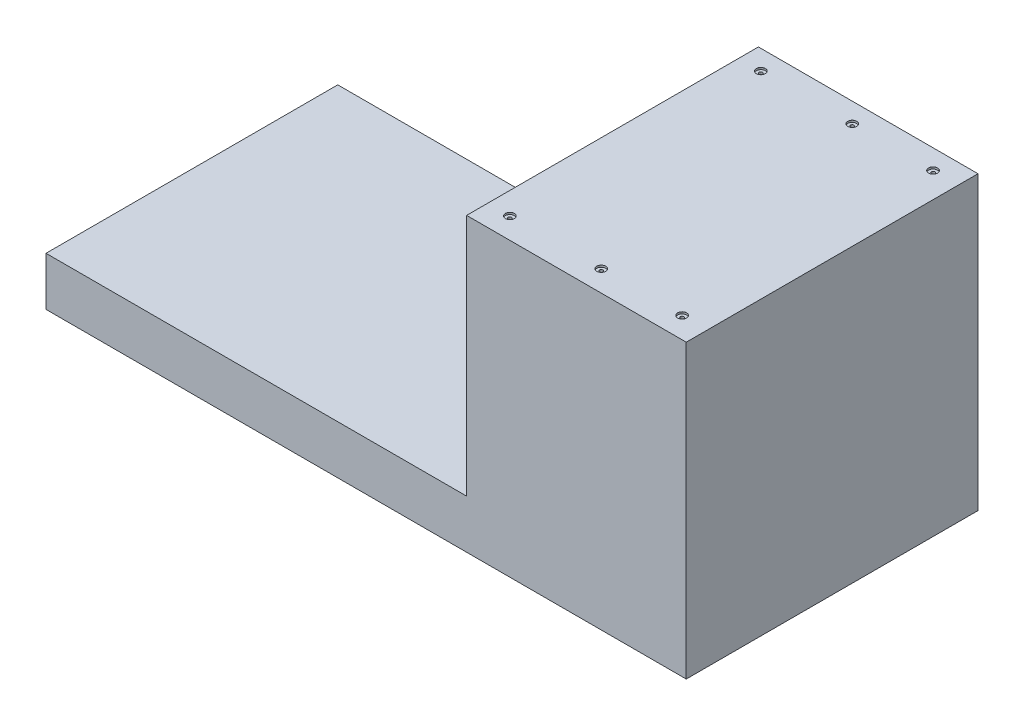
ISO-10303-21;
HEADER;
FILE_DESCRIPTION(('STEP AP214'),'2;1');
FILE_NAME('part.step','',(''),(''),'','','');
FILE_SCHEMA(('AUTOMOTIVE_DESIGN { 1 0 10303 214 1 1 1 1 }'));
ENDSEC;
DATA;
#1=APPLICATION_CONTEXT('core data for automotive mechanical design processes');
#2=APPLICATION_PROTOCOL_DEFINITION('international standard','automotive_design',2000,#1);
#3=PRODUCT_CONTEXT('',#1,'mechanical');
#4=PRODUCT('Part','Part','',(#3));
#5=PRODUCT_RELATED_PRODUCT_CATEGORY('part','',(#4));
#6=PRODUCT_DEFINITION_FORMATION('','',#4);
#7=PRODUCT_DEFINITION_CONTEXT('part definition',#1,'design');
#8=PRODUCT_DEFINITION('design','',#6,#7);
#9=PRODUCT_DEFINITION_SHAPE('','',#8);
#10=(LENGTH_UNIT() NAMED_UNIT(*) SI_UNIT(.MILLI.,.METRE.));
#11=(NAMED_UNIT(*) PLANE_ANGLE_UNIT() SI_UNIT($,.RADIAN.));
#12=(NAMED_UNIT(*) SI_UNIT($,.STERADIAN.) SOLID_ANGLE_UNIT());
#13=UNCERTAINTY_MEASURE_WITH_UNIT(LENGTH_MEASURE(1.E-05),#10,'distance_accuracy_value','');
#14=(GEOMETRIC_REPRESENTATION_CONTEXT(3) GLOBAL_UNCERTAINTY_ASSIGNED_CONTEXT((#13)) GLOBAL_UNIT_ASSIGNED_CONTEXT((#10,
#11,#12)) REPRESENTATION_CONTEXT('',''));
#15=CARTESIAN_POINT('',(0.,0.,0.));
#16=DIRECTION('',(0.,0.,1.));
#17=DIRECTION('',(1.,0.,0.));
#18=AXIS2_PLACEMENT_3D('',#15,#16,#17);
#19=CARTESIAN_POINT('',(254.,50.8,-152.4));
#20=DIRECTION('',(-1.,0.,0.));
#21=DIRECTION('',(0.,0.,1.));
#22=AXIS2_PLACEMENT_3D('',#19,#20,#21);
#23=PLANE('',#22);
#24=DIRECTION('',(0.,0.,-1.));
#25=VECTOR('',#24,1.);
#26=CARTESIAN_POINT('',(254.,0.,-152.4));
#27=LINE('',#26,#25);
#28=CARTESIAN_POINT('',(254.,0.,152.4));
#29=VERTEX_POINT('',#28);
#30=CARTESIAN_POINT('',(254.,0.,-152.4));
#31=VERTEX_POINT('',#30);
#32=EDGE_CURVE('E146',#29,#31,#27,.T.);
#33=ORIENTED_EDGE('',*,*,#32,.T.);
#34=DIRECTION('',(0.,-1.,0.));
#35=VECTOR('',#34,1.);
#36=CARTESIAN_POINT('',(254.,50.8,-152.4));
#37=LINE('',#36,#35);
#38=CARTESIAN_POINT('',(254.,304.8,-152.4));
#39=VERTEX_POINT('',#38);
#40=EDGE_CURVE('E11',#39,#31,#37,.T.);
#41=ORIENTED_EDGE('',*,*,#40,.F.);
#42=DIRECTION('',(0.,0.,-1.));
#43=VECTOR('',#42,1.);
#44=CARTESIAN_POINT('',(254.,304.8,-152.4));
#45=LINE('',#44,#43);
#46=CARTESIAN_POINT('',(254.,304.8,152.4));
#47=VERTEX_POINT('',#46);
#48=EDGE_CURVE('E134',#47,#39,#45,.T.);
#49=ORIENTED_EDGE('',*,*,#48,.F.);
#50=DIRECTION('',(0.,-1.,0.));
#51=VECTOR('',#50,1.);
#52=CARTESIAN_POINT('',(254.,50.8,152.4));
#53=LINE('',#52,#51);
#54=EDGE_CURVE('E46',#47,#29,#53,.T.);
#55=ORIENTED_EDGE('',*,*,#54,.T.);
#56=EDGE_LOOP('',(#33,#41,#49,#55));
#57=FACE_BOUND('',#56,.T.);
#58=ADVANCED_FACE('F38',(#57),#23,.F.);
#59=CARTESIAN_POINT('',(-254.,50.8,-152.4));
#60=DIRECTION('',(0.,0.,1.));
#61=DIRECTION('',(1.,0.,0.));
#62=AXIS2_PLACEMENT_3D('',#59,#60,#61);
#63=PLANE('',#62);
#64=DIRECTION('',(-1.,0.,0.));
#65=VECTOR('',#64,1.);
#66=CARTESIAN_POINT('',(-254.,0.,-152.4));
#67=LINE('',#66,#65);
#68=CARTESIAN_POINT('',(-414.851586112818,0.,-152.4));
#69=VERTEX_POINT('',#68);
#70=EDGE_CURVE('E111',#31,#69,#67,.T.);
#71=ORIENTED_EDGE('',*,*,#70,.T.);
#72=DIRECTION('',(0.,-1.,0.));
#73=VECTOR('',#72,1.);
#74=CARTESIAN_POINT('',(-414.851586112818,50.8,-152.4));
#75=LINE('',#74,#73);
#76=CARTESIAN_POINT('',(-414.851586112818,50.8,-152.4));
#77=VERTEX_POINT('',#76);
#78=EDGE_CURVE('E105',#77,#69,#75,.T.);
#79=ORIENTED_EDGE('',*,*,#78,.F.);
#80=DIRECTION('',(-1.,0.,0.));
#81=VECTOR('',#80,1.);
#82=CARTESIAN_POINT('',(-254.,50.8,-152.4));
#83=LINE('',#82,#81);
#84=CARTESIAN_POINT('',(24.5767588932806,50.8,-152.4));
#85=VERTEX_POINT('',#84);
#86=EDGE_CURVE('E89',#85,#77,#83,.T.);
#87=ORIENTED_EDGE('',*,*,#86,.F.);
#88=DIRECTION('',(0.,-1.,0.));
#89=VECTOR('',#88,1.);
#90=CARTESIAN_POINT('',(24.5767588932806,304.8,-152.4));
#91=LINE('',#90,#89);
#92=CARTESIAN_POINT('',(24.5767588932806,304.8,-152.4));
#93=VERTEX_POINT('',#92);
#94=EDGE_CURVE('E144',#93,#85,#91,.T.);
#95=ORIENTED_EDGE('',*,*,#94,.F.);
#96=DIRECTION('',(-1.,0.,0.));
#97=VECTOR('',#96,1.);
#98=CARTESIAN_POINT('',(24.5767588932806,304.8,-152.4));
#99=LINE('',#98,#97);
#100=EDGE_CURVE('E123',#39,#93,#99,.T.);
#101=ORIENTED_EDGE('',*,*,#100,.F.);
#102=ORIENTED_EDGE('',*,*,#40,.T.);
#103=EDGE_LOOP('',(#71,#79,#87,#95,#101,#102));
#104=FACE_BOUND('',#103,.T.);
#105=ADVANCED_FACE('F110',(#104),#63,.F.);
#106=CARTESIAN_POINT('',(-254.,50.8,152.4));
#107=DIRECTION('',(0.,0.,-1.));
#108=DIRECTION('',(-1.,0.,0.));
#109=AXIS2_PLACEMENT_3D('',#106,#107,#108);
#110=PLANE('',#109);
#111=DIRECTION('',(1.,0.,0.));
#112=VECTOR('',#111,1.);
#113=CARTESIAN_POINT('',(-254.,0.,152.4));
#114=LINE('',#113,#112);
#115=CARTESIAN_POINT('',(-414.851586112818,0.,152.4));
#116=VERTEX_POINT('',#115);
#117=EDGE_CURVE('E61',#116,#29,#114,.T.);
#118=ORIENTED_EDGE('',*,*,#117,.T.);
#119=ORIENTED_EDGE('',*,*,#54,.F.);
#120=DIRECTION('',(1.,0.,0.));
#121=VECTOR('',#120,1.);
#122=CARTESIAN_POINT('',(254.,304.8,152.4));
#123=LINE('',#122,#121);
#124=CARTESIAN_POINT('',(24.5767588932806,304.8,152.4));
#125=VERTEX_POINT('',#124);
#126=EDGE_CURVE('E130',#125,#47,#123,.T.);
#127=ORIENTED_EDGE('',*,*,#126,.F.);
#128=DIRECTION('',(0.,-1.,0.));
#129=VECTOR('',#128,1.);
#130=CARTESIAN_POINT('',(24.5767588932806,304.8,152.4));
#131=LINE('',#130,#129);
#132=CARTESIAN_POINT('',(24.5767588932806,50.8,152.4));
#133=VERTEX_POINT('',#132);
#134=EDGE_CURVE('E138',#125,#133,#131,.T.);
#135=ORIENTED_EDGE('',*,*,#134,.T.);
#136=DIRECTION('',(1.,0.,0.));
#137=VECTOR('',#136,1.);
#138=CARTESIAN_POINT('',(-254.,50.8,152.4));
#139=LINE('',#138,#137);
#140=CARTESIAN_POINT('',(-414.851586112818,50.8,152.4));
#141=VERTEX_POINT('',#140);
#142=EDGE_CURVE('E99',#141,#133,#139,.T.);
#143=ORIENTED_EDGE('',*,*,#142,.F.);
#144=DIRECTION('',(0.,-1.,0.));
#145=VECTOR('',#144,1.);
#146=CARTESIAN_POINT('',(-414.851586112818,50.8,152.4));
#147=LINE('',#146,#145);
#148=EDGE_CURVE('E106',#141,#116,#147,.T.);
#149=ORIENTED_EDGE('',*,*,#148,.T.);
#150=EDGE_LOOP('',(#118,#119,#127,#135,#143,#149));
#151=FACE_BOUND('',#150,.T.);
#152=ADVANCED_FACE('F167',(#151),#110,.F.);
#153=CARTESIAN_POINT('',(0.,50.8,0.));
#154=DIRECTION('',(0.,1.,0.));
#155=DIRECTION('',(0.,0.,1.));
#156=AXIS2_PLACEMENT_3D('',#153,#154,#155);
#157=PLANE('',#156);
#158=DIRECTION('',(0.,0.,1.));
#159=VECTOR('',#158,1.);
#160=CARTESIAN_POINT('',(24.5767588932806,50.8,152.4));
#161=LINE('',#160,#159);
#162=EDGE_CURVE('E53',#85,#133,#161,.T.);
#163=ORIENTED_EDGE('',*,*,#162,.F.);
#164=ORIENTED_EDGE('',*,*,#86,.T.);
#165=DIRECTION('',(0.,0.,1.));
#166=VECTOR('',#165,1.);
#167=CARTESIAN_POINT('',(-414.851586112818,50.8,-152.4));
#168=LINE('',#167,#166);
#169=EDGE_CURVE('E92',#77,#141,#168,.T.);
#170=ORIENTED_EDGE('',*,*,#169,.T.);
#171=ORIENTED_EDGE('',*,*,#142,.T.);
#172=EDGE_LOOP('',(#163,#164,#170,#171));
#173=FACE_BOUND('',#172,.T.);
#174=ADVANCED_FACE('F91',(#173),#157,.T.);
#175=CARTESIAN_POINT('',(0.,0.,0.));
#176=DIRECTION('',(0.,1.,0.));
#177=DIRECTION('',(0.,0.,1.));
#178=AXIS2_PLACEMENT_3D('',#175,#176,#177);
#179=PLANE('',#178);
#180=CARTESIAN_POINT('',(47.719356017687,0.,-131.816929849859));
#181=DIRECTION('',(0.,1.,0.));
#182=DIRECTION('',(0.,0.,1.));
#183=AXIS2_PLACEMENT_3D('',#180,#181,#182);
#184=CIRCLE('',#183,1.79999999999997);
#185=CARTESIAN_POINT('',(47.719356017687,0.,-130.016929849859));
#186=VERTEX_POINT('',#185);
#187=EDGE_CURVE('E472',#186,#186,#184,.T.);
#188=ORIENTED_EDGE('',*,*,#187,.T.);
#189=EDGE_LOOP('',(#188));
#190=FACE_BOUND('',#189,.T.);
#191=CARTESIAN_POINT('',(143.185656187501,0.,-131.816929849859));
#192=DIRECTION('',(0.,1.,0.));
#193=DIRECTION('',(0.,0.,1.));
#194=AXIS2_PLACEMENT_3D('',#191,#192,#193);
#195=CIRCLE('',#194,1.79999999999997);
#196=CARTESIAN_POINT('',(143.185656187501,0.,-130.016929849859));
#197=VERTEX_POINT('',#196);
#198=EDGE_CURVE('E492',#197,#197,#195,.T.);
#199=ORIENTED_EDGE('',*,*,#198,.T.);
#200=EDGE_LOOP('',(#199));
#201=FACE_BOUND('',#200,.T.);
#202=CARTESIAN_POINT('',(227.636614030028,0.,-131.816929849859));
#203=DIRECTION('',(0.,1.,0.));
#204=DIRECTION('',(0.,0.,1.));
#205=AXIS2_PLACEMENT_3D('',#202,#203,#204);
#206=CIRCLE('',#205,1.79999999999997);
#207=CARTESIAN_POINT('',(227.636614030028,0.,-130.016929849859));
#208=VERTEX_POINT('',#207);
#209=EDGE_CURVE('E512',#208,#208,#206,.T.);
#210=ORIENTED_EDGE('',*,*,#209,.T.);
#211=EDGE_LOOP('',(#210));
#212=FACE_BOUND('',#211,.T.);
#213=CARTESIAN_POINT('',(227.636614030028,0.,130.348217539552));
#214=DIRECTION('',(0.,1.,0.));
#215=DIRECTION('',(0.,0.,1.));
#216=AXIS2_PLACEMENT_3D('',#213,#214,#215);
#217=CIRCLE('',#216,1.79999999999997);
#218=CARTESIAN_POINT('',(227.636614030028,0.,132.148217539552));
#219=VERTEX_POINT('',#218);
#220=EDGE_CURVE('E532',#219,#219,#217,.T.);
#221=ORIENTED_EDGE('',*,*,#220,.T.);
#222=EDGE_LOOP('',(#221));
#223=FACE_BOUND('',#222,.T.);
#224=CARTESIAN_POINT('',(143.185656187501,0.,130.348217539552));
#225=DIRECTION('',(0.,1.,0.));
#226=DIRECTION('',(0.,0.,1.));
#227=AXIS2_PLACEMENT_3D('',#224,#225,#226);
#228=CIRCLE('',#227,1.79999999999997);
#229=CARTESIAN_POINT('',(143.185656187501,0.,132.148217539552));
#230=VERTEX_POINT('',#229);
#231=EDGE_CURVE('E552',#230,#230,#228,.T.);
#232=ORIENTED_EDGE('',*,*,#231,.T.);
#233=EDGE_LOOP('',(#232));
#234=FACE_BOUND('',#233,.T.);
#235=CARTESIAN_POINT('',(47.719356017687,0.,130.348217539552));
#236=DIRECTION('',(0.,1.,0.));
#237=DIRECTION('',(0.,0.,1.));
#238=AXIS2_PLACEMENT_3D('',#235,#236,#237);
#239=CIRCLE('',#238,1.79999999999997);
#240=CARTESIAN_POINT('',(47.719356017687,0.,132.148217539552));
#241=VERTEX_POINT('',#240);
#242=EDGE_CURVE('E116',#241,#241,#239,.T.);
#243=ORIENTED_EDGE('',*,*,#242,.T.);
#244=EDGE_LOOP('',(#243));
#245=FACE_BOUND('',#244,.T.);
#246=ORIENTED_EDGE('',*,*,#32,.F.);
#247=ORIENTED_EDGE('',*,*,#117,.F.);
#248=DIRECTION('',(0.,0.,1.));
#249=VECTOR('',#248,1.);
#250=CARTESIAN_POINT('',(-414.851586112818,0.,-152.4));
#251=LINE('',#250,#249);
#252=EDGE_CURVE('E108',#69,#116,#251,.T.);
#253=ORIENTED_EDGE('',*,*,#252,.F.);
#254=ORIENTED_EDGE('',*,*,#70,.F.);
#255=EDGE_LOOP('',(#246,#247,#253,#254));
#256=FACE_BOUND('',#255,.T.);
#257=ADVANCED_FACE('F162',(#190,#201,#212,#223,#234,#245,#256),#179,.F.);
#258=CARTESIAN_POINT('',(24.5767588932806,304.8,152.4));
#259=DIRECTION('',(1.,0.,0.));
#260=DIRECTION('',(0.,0.,-1.));
#261=AXIS2_PLACEMENT_3D('',#258,#259,#260);
#262=PLANE('',#261);
#263=ORIENTED_EDGE('',*,*,#162,.T.);
#264=ORIENTED_EDGE('',*,*,#134,.F.);
#265=DIRECTION('',(0.,0.,1.));
#266=VECTOR('',#265,1.);
#267=CARTESIAN_POINT('',(24.5767588932806,304.8,152.4));
#268=LINE('',#267,#266);
#269=EDGE_CURVE('E127',#93,#125,#268,.T.);
#270=ORIENTED_EDGE('',*,*,#269,.F.);
#271=ORIENTED_EDGE('',*,*,#94,.T.);
#272=EDGE_LOOP('',(#263,#264,#270,#271));
#273=FACE_BOUND('',#272,.T.);
#274=ADVANCED_FACE('F169',(#273),#262,.F.);
#275=CARTESIAN_POINT('',(0.,304.8,0.));
#276=DIRECTION('',(0.,-1.,0.));
#277=DIRECTION('',(0.,0.,-1.));
#278=AXIS2_PLACEMENT_3D('',#275,#276,#277);
#279=PLANE('',#278);
#280=CARTESIAN_POINT('',(47.719356017687,304.8,-131.816929849859));
#281=DIRECTION('',(0.,1.,0.));
#282=DIRECTION('',(0.,0.,1.));
#283=AXIS2_PLACEMENT_3D('',#280,#281,#282);
#284=CIRCLE('',#283,4.7005);
#285=CARTESIAN_POINT('',(47.719356017687,304.8,-127.116429849859));
#286=VERTEX_POINT('',#285);
#287=EDGE_CURVE('E458',#286,#286,#284,.T.);
#288=ORIENTED_EDGE('',*,*,#287,.F.);
#289=EDGE_LOOP('',(#288));
#290=FACE_BOUND('',#289,.T.);
#291=CARTESIAN_POINT('',(143.185656187501,304.8,-131.816929849859));
#292=DIRECTION('',(0.,1.,0.));
#293=DIRECTION('',(0.,0.,1.));
#294=AXIS2_PLACEMENT_3D('',#291,#292,#293);
#295=CIRCLE('',#294,4.7005);
#296=CARTESIAN_POINT('',(143.185656187501,304.8,-127.116429849859));
#297=VERTEX_POINT('',#296);
#298=EDGE_CURVE('E476',#297,#297,#295,.T.);
#299=ORIENTED_EDGE('',*,*,#298,.F.);
#300=EDGE_LOOP('',(#299));
#301=FACE_BOUND('',#300,.T.);
#302=CARTESIAN_POINT('',(227.636614030028,304.8,-131.816929849859));
#303=DIRECTION('',(0.,1.,0.));
#304=DIRECTION('',(0.,0.,1.));
#305=AXIS2_PLACEMENT_3D('',#302,#303,#304);
#306=CIRCLE('',#305,4.7005);
#307=CARTESIAN_POINT('',(227.636614030028,304.8,-127.116429849859));
#308=VERTEX_POINT('',#307);
#309=EDGE_CURVE('E496',#308,#308,#306,.T.);
#310=ORIENTED_EDGE('',*,*,#309,.F.);
#311=EDGE_LOOP('',(#310));
#312=FACE_BOUND('',#311,.T.);
#313=CARTESIAN_POINT('',(227.636614030028,304.8,130.348217539552));
#314=DIRECTION('',(0.,1.,0.));
#315=DIRECTION('',(0.,0.,1.));
#316=AXIS2_PLACEMENT_3D('',#313,#314,#315);
#317=CIRCLE('',#316,4.7005);
#318=CARTESIAN_POINT('',(227.636614030028,304.8,135.048717539552));
#319=VERTEX_POINT('',#318);
#320=EDGE_CURVE('E516',#319,#319,#317,.T.);
#321=ORIENTED_EDGE('',*,*,#320,.F.);
#322=EDGE_LOOP('',(#321));
#323=FACE_BOUND('',#322,.T.);
#324=CARTESIAN_POINT('',(143.185656187501,304.8,130.348217539552));
#325=DIRECTION('',(0.,1.,0.));
#326=DIRECTION('',(0.,0.,1.));
#327=AXIS2_PLACEMENT_3D('',#324,#325,#326);
#328=CIRCLE('',#327,4.7005);
#329=CARTESIAN_POINT('',(143.185656187501,304.8,135.048717539552));
#330=VERTEX_POINT('',#329);
#331=EDGE_CURVE('E536',#330,#330,#328,.T.);
#332=ORIENTED_EDGE('',*,*,#331,.F.);
#333=EDGE_LOOP('',(#332));
#334=FACE_BOUND('',#333,.T.);
#335=CARTESIAN_POINT('',(47.719356017687,304.8,130.348217539552));
#336=DIRECTION('',(0.,1.,0.));
#337=DIRECTION('',(0.,0.,1.));
#338=AXIS2_PLACEMENT_3D('',#335,#336,#337);
#339=CIRCLE('',#338,4.7005);
#340=CARTESIAN_POINT('',(47.719356017687,304.8,135.048717539552));
#341=VERTEX_POINT('',#340);
#342=EDGE_CURVE('E556',#341,#341,#339,.T.);
#343=ORIENTED_EDGE('',*,*,#342,.F.);
#344=EDGE_LOOP('',(#343));
#345=FACE_BOUND('',#344,.T.);
#346=ORIENTED_EDGE('',*,*,#100,.T.);
#347=ORIENTED_EDGE('',*,*,#269,.T.);
#348=ORIENTED_EDGE('',*,*,#126,.T.);
#349=ORIENTED_EDGE('',*,*,#48,.T.);
#350=EDGE_LOOP('',(#346,#347,#348,#349));
#351=FACE_BOUND('',#350,.T.);
#352=ADVANCED_FACE('F165',(#290,#301,#312,#323,#334,#345,#351),#279,.F.);
#353=CARTESIAN_POINT('',(-414.851586112818,50.8,-152.4));
#354=DIRECTION('',(-1.,0.,0.));
#355=DIRECTION('',(0.,0.,1.));
#356=AXIS2_PLACEMENT_3D('',#353,#354,#355);
#357=PLANE('',#356);
#358=ORIENTED_EDGE('',*,*,#148,.F.);
#359=ORIENTED_EDGE('',*,*,#169,.F.);
#360=ORIENTED_EDGE('',*,*,#78,.T.);
#361=ORIENTED_EDGE('',*,*,#252,.T.);
#362=EDGE_LOOP('',(#358,#359,#360,#361));
#363=FACE_BOUND('',#362,.T.);
#364=ADVANCED_FACE('F103',(#363),#357,.T.);
#365=CARTESIAN_POINT('',(47.719356017687,304.8,130.348217539552));
#366=DIRECTION('',(0.,1.,0.));
#367=DIRECTION('',(0.,0.,1.));
#368=AXIS2_PLACEMENT_3D('',#365,#366,#367);
#369=CYLINDRICAL_SURFACE('',#368,1.79999999999997);
#370=ORIENTED_EDGE('',*,*,#242,.F.);
#371=EDGE_LOOP('',(#370));
#372=FACE_BOUND('',#371,.T.);
#373=CARTESIAN_POINT('',(47.719356017687,302.8,130.348217539552));
#374=DIRECTION('',(0.,1.,0.));
#375=DIRECTION('',(0.,0.,1.));
#376=AXIS2_PLACEMENT_3D('',#373,#374,#375);
#377=CIRCLE('',#376,1.80000000000001);
#378=CARTESIAN_POINT('',(47.719356017687,302.8,132.148217539552));
#379=VERTEX_POINT('',#378);
#380=EDGE_CURVE('E567',#379,#379,#377,.T.);
#381=ORIENTED_EDGE('',*,*,#380,.T.);
#382=EDGE_LOOP('',(#381));
#383=FACE_BOUND('',#382,.T.);
#384=ADVANCED_FACE('F209',(#372,#383),#369,.F.);
#385=CARTESIAN_POINT('',(52.394856017687,302.8,130.348217539552));
#386=DIRECTION('',(0.,-1.,0.));
#387=DIRECTION('',(0.,0.,-1.));
#388=AXIS2_PLACEMENT_3D('',#385,#386,#387);
#389=PLANE('',#388);
#390=ORIENTED_EDGE('',*,*,#380,.F.);
#391=EDGE_LOOP('',(#390));
#392=FACE_BOUND('',#391,.T.);
#393=CARTESIAN_POINT('',(47.719356017687,302.8,130.348217539552));
#394=DIRECTION('',(0.,1.,0.));
#395=DIRECTION('',(0.,0.,1.));
#396=AXIS2_PLACEMENT_3D('',#393,#394,#395);
#397=CIRCLE('',#396,4.6755);
#398=CARTESIAN_POINT('',(47.719356017687,302.8,135.023717539552));
#399=VERTEX_POINT('',#398);
#400=EDGE_CURVE('E564',#399,#399,#397,.T.);
#401=ORIENTED_EDGE('',*,*,#400,.T.);
#402=EDGE_LOOP('',(#401));
#403=FACE_BOUND('',#402,.T.);
#404=ADVANCED_FACE('F215',(#392,#403),#389,.F.);
#405=CARTESIAN_POINT('',(47.719356017687,304.8,130.348217539552));
#406=DIRECTION('',(0.,1.,0.));
#407=DIRECTION('',(0.,0.,1.));
#408=AXIS2_PLACEMENT_3D('',#405,#406,#407);
#409=CYLINDRICAL_SURFACE('',#408,4.6755);
#410=ORIENTED_EDGE('',*,*,#400,.F.);
#411=EDGE_LOOP('',(#410));
#412=FACE_BOUND('',#411,.T.);
#413=CARTESIAN_POINT('',(47.719356017687,304.775,130.348217539552));
#414=DIRECTION('',(0.,1.,0.));
#415=DIRECTION('',(0.,0.,1.));
#416=AXIS2_PLACEMENT_3D('',#413,#414,#415);
#417=CIRCLE('',#416,4.6755);
#418=CARTESIAN_POINT('',(47.719356017687,304.775,135.023717539552));
#419=VERTEX_POINT('',#418);
#420=EDGE_CURVE('E560',#419,#419,#417,.T.);
#421=ORIENTED_EDGE('',*,*,#420,.T.);
#422=EDGE_LOOP('',(#421));
#423=FACE_BOUND('',#422,.T.);
#424=ADVANCED_FACE('F223',(#412,#423),#409,.F.);
#425=CARTESIAN_POINT('',(47.719356017687,304.8,130.348217539552));
#426=DIRECTION('',(0.,1.,0.));
#427=DIRECTION('',(0.,0.,1.));
#428=AXIS2_PLACEMENT_3D('',#425,#426,#427);
#429=CONICAL_SURFACE('',#428,4.7005,0.785398163397448);
#430=ORIENTED_EDGE('',*,*,#420,.F.);
#431=EDGE_LOOP('',(#430));
#432=FACE_BOUND('',#431,.T.);
#433=ORIENTED_EDGE('',*,*,#342,.T.);
#434=EDGE_LOOP('',(#433));
#435=FACE_BOUND('',#434,.T.);
#436=ADVANCED_FACE('F231',(#432,#435),#429,.F.);
#437=CARTESIAN_POINT('',(143.185656187501,304.8,130.348217539552));
#438=DIRECTION('',(0.,1.,0.));
#439=DIRECTION('',(0.,0.,1.));
#440=AXIS2_PLACEMENT_3D('',#437,#438,#439);
#441=CYLINDRICAL_SURFACE('',#440,1.79999999999997);
#442=ORIENTED_EDGE('',*,*,#231,.F.);
#443=EDGE_LOOP('',(#442));
#444=FACE_BOUND('',#443,.T.);
#445=CARTESIAN_POINT('',(143.185656187501,302.8,130.348217539552));
#446=DIRECTION('',(0.,1.,0.));
#447=DIRECTION('',(0.,0.,1.));
#448=AXIS2_PLACEMENT_3D('',#445,#446,#447);
#449=CIRCLE('',#448,1.80000000000002);
#450=CARTESIAN_POINT('',(143.185656187501,302.8,132.148217539552));
#451=VERTEX_POINT('',#450);
#452=EDGE_CURVE('E548',#451,#451,#449,.T.);
#453=ORIENTED_EDGE('',*,*,#452,.T.);
#454=EDGE_LOOP('',(#453));
#455=FACE_BOUND('',#454,.T.);
#456=ADVANCED_FACE('F239',(#444,#455),#441,.F.);
#457=CARTESIAN_POINT('',(147.861156187501,302.8,130.348217539552));
#458=DIRECTION('',(0.,-1.,0.));
#459=DIRECTION('',(0.,0.,-1.));
#460=AXIS2_PLACEMENT_3D('',#457,#458,#459);
#461=PLANE('',#460);
#462=ORIENTED_EDGE('',*,*,#452,.F.);
#463=EDGE_LOOP('',(#462));
#464=FACE_BOUND('',#463,.T.);
#465=CARTESIAN_POINT('',(143.185656187501,302.8,130.348217539552));
#466=DIRECTION('',(0.,1.,0.));
#467=DIRECTION('',(0.,0.,1.));
#468=AXIS2_PLACEMENT_3D('',#465,#466,#467);
#469=CIRCLE('',#468,4.6755);
#470=CARTESIAN_POINT('',(143.185656187501,302.8,135.023717539552));
#471=VERTEX_POINT('',#470);
#472=EDGE_CURVE('E544',#471,#471,#469,.T.);
#473=ORIENTED_EDGE('',*,*,#472,.T.);
#474=EDGE_LOOP('',(#473));
#475=FACE_BOUND('',#474,.T.);
#476=ADVANCED_FACE('F247',(#464,#475),#461,.F.);
#477=CARTESIAN_POINT('',(143.185656187501,304.8,130.348217539552));
#478=DIRECTION('',(0.,1.,0.));
#479=DIRECTION('',(0.,0.,1.));
#480=AXIS2_PLACEMENT_3D('',#477,#478,#479);
#481=CYLINDRICAL_SURFACE('',#480,4.6755);
#482=ORIENTED_EDGE('',*,*,#472,.F.);
#483=EDGE_LOOP('',(#482));
#484=FACE_BOUND('',#483,.T.);
#485=CARTESIAN_POINT('',(143.185656187501,304.775,130.348217539552));
#486=DIRECTION('',(0.,1.,0.));
#487=DIRECTION('',(0.,0.,1.));
#488=AXIS2_PLACEMENT_3D('',#485,#486,#487);
#489=CIRCLE('',#488,4.6755);
#490=CARTESIAN_POINT('',(143.185656187501,304.775,135.023717539552));
#491=VERTEX_POINT('',#490);
#492=EDGE_CURVE('E540',#491,#491,#489,.T.);
#493=ORIENTED_EDGE('',*,*,#492,.T.);
#494=EDGE_LOOP('',(#493));
#495=FACE_BOUND('',#494,.T.);
#496=ADVANCED_FACE('F255',(#484,#495),#481,.F.);
#497=CARTESIAN_POINT('',(143.185656187501,304.8,130.348217539552));
#498=DIRECTION('',(0.,1.,0.));
#499=DIRECTION('',(0.,0.,1.));
#500=AXIS2_PLACEMENT_3D('',#497,#498,#499);
#501=CONICAL_SURFACE('',#500,4.7005,0.785398163397448);
#502=ORIENTED_EDGE('',*,*,#492,.F.);
#503=EDGE_LOOP('',(#502));
#504=FACE_BOUND('',#503,.T.);
#505=ORIENTED_EDGE('',*,*,#331,.T.);
#506=EDGE_LOOP('',(#505));
#507=FACE_BOUND('',#506,.T.);
#508=ADVANCED_FACE('F263',(#504,#507),#501,.F.);
#509=CARTESIAN_POINT('',(227.636614030028,304.8,130.348217539552));
#510=DIRECTION('',(0.,1.,0.));
#511=DIRECTION('',(0.,0.,1.));
#512=AXIS2_PLACEMENT_3D('',#509,#510,#511);
#513=CYLINDRICAL_SURFACE('',#512,1.79999999999997);
#514=ORIENTED_EDGE('',*,*,#220,.F.);
#515=EDGE_LOOP('',(#514));
#516=FACE_BOUND('',#515,.T.);
#517=CARTESIAN_POINT('',(227.636614030028,302.8,130.348217539552));
#518=DIRECTION('',(0.,1.,0.));
#519=DIRECTION('',(0.,0.,1.));
#520=AXIS2_PLACEMENT_3D('',#517,#518,#519);
#521=CIRCLE('',#520,1.80000000000002);
#522=CARTESIAN_POINT('',(227.636614030028,302.8,132.148217539552));
#523=VERTEX_POINT('',#522);
#524=EDGE_CURVE('E528',#523,#523,#521,.T.);
#525=ORIENTED_EDGE('',*,*,#524,.T.);
#526=EDGE_LOOP('',(#525));
#527=FACE_BOUND('',#526,.T.);
#528=ADVANCED_FACE('F271',(#516,#527),#513,.F.);
#529=CARTESIAN_POINT('',(232.312114030028,302.8,130.348217539552));
#530=DIRECTION('',(0.,-1.,0.));
#531=DIRECTION('',(0.,0.,-1.));
#532=AXIS2_PLACEMENT_3D('',#529,#530,#531);
#533=PLANE('',#532);
#534=ORIENTED_EDGE('',*,*,#524,.F.);
#535=EDGE_LOOP('',(#534));
#536=FACE_BOUND('',#535,.T.);
#537=CARTESIAN_POINT('',(227.636614030028,302.8,130.348217539552));
#538=DIRECTION('',(0.,1.,0.));
#539=DIRECTION('',(0.,0.,1.));
#540=AXIS2_PLACEMENT_3D('',#537,#538,#539);
#541=CIRCLE('',#540,4.6755);
#542=CARTESIAN_POINT('',(227.636614030028,302.8,135.023717539552));
#543=VERTEX_POINT('',#542);
#544=EDGE_CURVE('E524',#543,#543,#541,.T.);
#545=ORIENTED_EDGE('',*,*,#544,.T.);
#546=EDGE_LOOP('',(#545));
#547=FACE_BOUND('',#546,.T.);
#548=ADVANCED_FACE('F279',(#536,#547),#533,.F.);
#549=CARTESIAN_POINT('',(227.636614030028,304.8,130.348217539552));
#550=DIRECTION('',(0.,1.,0.));
#551=DIRECTION('',(0.,0.,1.));
#552=AXIS2_PLACEMENT_3D('',#549,#550,#551);
#553=CYLINDRICAL_SURFACE('',#552,4.6755);
#554=ORIENTED_EDGE('',*,*,#544,.F.);
#555=EDGE_LOOP('',(#554));
#556=FACE_BOUND('',#555,.T.);
#557=CARTESIAN_POINT('',(227.636614030028,304.775,130.348217539552));
#558=DIRECTION('',(0.,1.,0.));
#559=DIRECTION('',(0.,0.,1.));
#560=AXIS2_PLACEMENT_3D('',#557,#558,#559);
#561=CIRCLE('',#560,4.6755);
#562=CARTESIAN_POINT('',(227.636614030028,304.775,135.023717539552));
#563=VERTEX_POINT('',#562);
#564=EDGE_CURVE('E520',#563,#563,#561,.T.);
#565=ORIENTED_EDGE('',*,*,#564,.T.);
#566=EDGE_LOOP('',(#565));
#567=FACE_BOUND('',#566,.T.);
#568=ADVANCED_FACE('F287',(#556,#567),#553,.F.);
#569=CARTESIAN_POINT('',(227.636614030028,304.8,130.348217539552));
#570=DIRECTION('',(0.,1.,0.));
#571=DIRECTION('',(0.,0.,1.));
#572=AXIS2_PLACEMENT_3D('',#569,#570,#571);
#573=CONICAL_SURFACE('',#572,4.7005,0.785398163397448);
#574=ORIENTED_EDGE('',*,*,#564,.F.);
#575=EDGE_LOOP('',(#574));
#576=FACE_BOUND('',#575,.T.);
#577=ORIENTED_EDGE('',*,*,#320,.T.);
#578=EDGE_LOOP('',(#577));
#579=FACE_BOUND('',#578,.T.);
#580=ADVANCED_FACE('F295',(#576,#579),#573,.F.);
#581=CARTESIAN_POINT('',(227.636614030028,304.8,-131.816929849859));
#582=DIRECTION('',(0.,1.,0.));
#583=DIRECTION('',(0.,0.,1.));
#584=AXIS2_PLACEMENT_3D('',#581,#582,#583);
#585=CYLINDRICAL_SURFACE('',#584,1.79999999999997);
#586=ORIENTED_EDGE('',*,*,#209,.F.);
#587=EDGE_LOOP('',(#586));
#588=FACE_BOUND('',#587,.T.);
#589=CARTESIAN_POINT('',(227.636614030028,302.8,-131.816929849859));
#590=DIRECTION('',(0.,1.,0.));
#591=DIRECTION('',(0.,0.,1.));
#592=AXIS2_PLACEMENT_3D('',#589,#590,#591);
#593=CIRCLE('',#592,1.80000000000002);
#594=CARTESIAN_POINT('',(227.636614030028,302.8,-130.016929849859));
#595=VERTEX_POINT('',#594);
#596=EDGE_CURVE('E508',#595,#595,#593,.T.);
#597=ORIENTED_EDGE('',*,*,#596,.T.);
#598=EDGE_LOOP('',(#597));
#599=FACE_BOUND('',#598,.T.);
#600=ADVANCED_FACE('F303',(#588,#599),#585,.F.);
#601=CARTESIAN_POINT('',(232.312114030028,302.8,-131.816929849859));
#602=DIRECTION('',(0.,-1.,0.));
#603=DIRECTION('',(0.,0.,-1.));
#604=AXIS2_PLACEMENT_3D('',#601,#602,#603);
#605=PLANE('',#604);
#606=ORIENTED_EDGE('',*,*,#596,.F.);
#607=EDGE_LOOP('',(#606));
#608=FACE_BOUND('',#607,.T.);
#609=CARTESIAN_POINT('',(227.636614030028,302.8,-131.816929849859));
#610=DIRECTION('',(0.,1.,0.));
#611=DIRECTION('',(0.,0.,1.));
#612=AXIS2_PLACEMENT_3D('',#609,#610,#611);
#613=CIRCLE('',#612,4.6755);
#614=CARTESIAN_POINT('',(227.636614030028,302.8,-127.141429849859));
#615=VERTEX_POINT('',#614);
#616=EDGE_CURVE('E504',#615,#615,#613,.T.);
#617=ORIENTED_EDGE('',*,*,#616,.T.);
#618=EDGE_LOOP('',(#617));
#619=FACE_BOUND('',#618,.T.);
#620=ADVANCED_FACE('F311',(#608,#619),#605,.F.);
#621=CARTESIAN_POINT('',(227.636614030028,304.8,-131.816929849859));
#622=DIRECTION('',(0.,1.,0.));
#623=DIRECTION('',(0.,0.,1.));
#624=AXIS2_PLACEMENT_3D('',#621,#622,#623);
#625=CYLINDRICAL_SURFACE('',#624,4.6755);
#626=ORIENTED_EDGE('',*,*,#616,.F.);
#627=EDGE_LOOP('',(#626));
#628=FACE_BOUND('',#627,.T.);
#629=CARTESIAN_POINT('',(227.636614030028,304.775,-131.816929849859));
#630=DIRECTION('',(0.,1.,0.));
#631=DIRECTION('',(0.,0.,1.));
#632=AXIS2_PLACEMENT_3D('',#629,#630,#631);
#633=CIRCLE('',#632,4.6755);
#634=CARTESIAN_POINT('',(227.636614030028,304.775,-127.141429849859));
#635=VERTEX_POINT('',#634);
#636=EDGE_CURVE('E500',#635,#635,#633,.T.);
#637=ORIENTED_EDGE('',*,*,#636,.T.);
#638=EDGE_LOOP('',(#637));
#639=FACE_BOUND('',#638,.T.);
#640=ADVANCED_FACE('F319',(#628,#639),#625,.F.);
#641=CARTESIAN_POINT('',(227.636614030028,304.8,-131.816929849859));
#642=DIRECTION('',(0.,1.,0.));
#643=DIRECTION('',(0.,0.,1.));
#644=AXIS2_PLACEMENT_3D('',#641,#642,#643);
#645=CONICAL_SURFACE('',#644,4.7005,0.785398163397448);
#646=ORIENTED_EDGE('',*,*,#636,.F.);
#647=EDGE_LOOP('',(#646));
#648=FACE_BOUND('',#647,.T.);
#649=ORIENTED_EDGE('',*,*,#309,.T.);
#650=EDGE_LOOP('',(#649));
#651=FACE_BOUND('',#650,.T.);
#652=ADVANCED_FACE('F327',(#648,#651),#645,.F.);
#653=CARTESIAN_POINT('',(143.185656187501,304.8,-131.816929849859));
#654=DIRECTION('',(0.,1.,0.));
#655=DIRECTION('',(0.,0.,1.));
#656=AXIS2_PLACEMENT_3D('',#653,#654,#655);
#657=CYLINDRICAL_SURFACE('',#656,1.79999999999997);
#658=ORIENTED_EDGE('',*,*,#198,.F.);
#659=EDGE_LOOP('',(#658));
#660=FACE_BOUND('',#659,.T.);
#661=CARTESIAN_POINT('',(143.185656187501,302.8,-131.816929849859));
#662=DIRECTION('',(0.,1.,0.));
#663=DIRECTION('',(0.,0.,1.));
#664=AXIS2_PLACEMENT_3D('',#661,#662,#663);
#665=CIRCLE('',#664,1.80000000000002);
#666=CARTESIAN_POINT('',(143.185656187501,302.8,-130.016929849859));
#667=VERTEX_POINT('',#666);
#668=EDGE_CURVE('E488',#667,#667,#665,.T.);
#669=ORIENTED_EDGE('',*,*,#668,.T.);
#670=EDGE_LOOP('',(#669));
#671=FACE_BOUND('',#670,.T.);
#672=ADVANCED_FACE('F335',(#660,#671),#657,.F.);
#673=CARTESIAN_POINT('',(147.861156187501,302.8,-131.816929849859));
#674=DIRECTION('',(0.,-1.,0.));
#675=DIRECTION('',(0.,0.,-1.));
#676=AXIS2_PLACEMENT_3D('',#673,#674,#675);
#677=PLANE('',#676);
#678=ORIENTED_EDGE('',*,*,#668,.F.);
#679=EDGE_LOOP('',(#678));
#680=FACE_BOUND('',#679,.T.);
#681=CARTESIAN_POINT('',(143.185656187501,302.8,-131.816929849859));
#682=DIRECTION('',(0.,1.,0.));
#683=DIRECTION('',(0.,0.,1.));
#684=AXIS2_PLACEMENT_3D('',#681,#682,#683);
#685=CIRCLE('',#684,4.6755);
#686=CARTESIAN_POINT('',(143.185656187501,302.8,-127.141429849859));
#687=VERTEX_POINT('',#686);
#688=EDGE_CURVE('E484',#687,#687,#685,.T.);
#689=ORIENTED_EDGE('',*,*,#688,.T.);
#690=EDGE_LOOP('',(#689));
#691=FACE_BOUND('',#690,.T.);
#692=ADVANCED_FACE('F343',(#680,#691),#677,.F.);
#693=CARTESIAN_POINT('',(143.185656187501,304.8,-131.816929849859));
#694=DIRECTION('',(0.,1.,0.));
#695=DIRECTION('',(0.,0.,1.));
#696=AXIS2_PLACEMENT_3D('',#693,#694,#695);
#697=CYLINDRICAL_SURFACE('',#696,4.6755);
#698=ORIENTED_EDGE('',*,*,#688,.F.);
#699=EDGE_LOOP('',(#698));
#700=FACE_BOUND('',#699,.T.);
#701=CARTESIAN_POINT('',(143.185656187501,304.775,-131.816929849859));
#702=DIRECTION('',(0.,1.,0.));
#703=DIRECTION('',(0.,0.,1.));
#704=AXIS2_PLACEMENT_3D('',#701,#702,#703);
#705=CIRCLE('',#704,4.6755);
#706=CARTESIAN_POINT('',(143.185656187501,304.775,-127.141429849859));
#707=VERTEX_POINT('',#706);
#708=EDGE_CURVE('E480',#707,#707,#705,.T.);
#709=ORIENTED_EDGE('',*,*,#708,.T.);
#710=EDGE_LOOP('',(#709));
#711=FACE_BOUND('',#710,.T.);
#712=ADVANCED_FACE('F351',(#700,#711),#697,.F.);
#713=CARTESIAN_POINT('',(143.185656187501,304.8,-131.816929849859));
#714=DIRECTION('',(0.,1.,0.));
#715=DIRECTION('',(0.,0.,1.));
#716=AXIS2_PLACEMENT_3D('',#713,#714,#715);
#717=CONICAL_SURFACE('',#716,4.7005,0.785398163397448);
#718=ORIENTED_EDGE('',*,*,#708,.F.);
#719=EDGE_LOOP('',(#718));
#720=FACE_BOUND('',#719,.T.);
#721=ORIENTED_EDGE('',*,*,#298,.T.);
#722=EDGE_LOOP('',(#721));
#723=FACE_BOUND('',#722,.T.);
#724=ADVANCED_FACE('F359',(#720,#723),#717,.F.);
#725=CARTESIAN_POINT('',(47.719356017687,304.8,-131.816929849859));
#726=DIRECTION('',(0.,1.,0.));
#727=DIRECTION('',(0.,0.,1.));
#728=AXIS2_PLACEMENT_3D('',#725,#726,#727);
#729=CYLINDRICAL_SURFACE('',#728,1.79999999999997);
#730=ORIENTED_EDGE('',*,*,#187,.F.);
#731=EDGE_LOOP('',(#730));
#732=FACE_BOUND('',#731,.T.);
#733=CARTESIAN_POINT('',(47.719356017687,302.8,-131.816929849859));
#734=DIRECTION('',(0.,1.,0.));
#735=DIRECTION('',(0.,0.,1.));
#736=AXIS2_PLACEMENT_3D('',#733,#734,#735);
#737=CIRCLE('',#736,1.80000000000001);
#738=CARTESIAN_POINT('',(47.719356017687,302.8,-130.016929849859));
#739=VERTEX_POINT('',#738);
#740=EDGE_CURVE('E468',#739,#739,#737,.T.);
#741=ORIENTED_EDGE('',*,*,#740,.T.);
#742=EDGE_LOOP('',(#741));
#743=FACE_BOUND('',#742,.T.);
#744=ADVANCED_FACE('F367',(#732,#743),#729,.F.);
#745=CARTESIAN_POINT('',(52.394856017687,302.8,-131.816929849859));
#746=DIRECTION('',(0.,-1.,0.));
#747=DIRECTION('',(0.,0.,-1.));
#748=AXIS2_PLACEMENT_3D('',#745,#746,#747);
#749=PLANE('',#748);
#750=ORIENTED_EDGE('',*,*,#740,.F.);
#751=EDGE_LOOP('',(#750));
#752=FACE_BOUND('',#751,.T.);
#753=CARTESIAN_POINT('',(47.719356017687,302.8,-131.816929849859));
#754=DIRECTION('',(0.,1.,0.));
#755=DIRECTION('',(0.,0.,1.));
#756=AXIS2_PLACEMENT_3D('',#753,#754,#755);
#757=CIRCLE('',#756,4.6755);
#758=CARTESIAN_POINT('',(47.719356017687,302.8,-127.141429849859));
#759=VERTEX_POINT('',#758);
#760=EDGE_CURVE('E462',#759,#759,#757,.T.);
#761=ORIENTED_EDGE('',*,*,#760,.T.);
#762=EDGE_LOOP('',(#761));
#763=FACE_BOUND('',#762,.T.);
#764=ADVANCED_FACE('F375',(#752,#763),#749,.F.);
#765=CARTESIAN_POINT('',(47.719356017687,304.8,-131.816929849859));
#766=DIRECTION('',(0.,1.,0.));
#767=DIRECTION('',(0.,0.,1.));
#768=AXIS2_PLACEMENT_3D('',#765,#766,#767);
#769=CYLINDRICAL_SURFACE('',#768,4.6755);
#770=ORIENTED_EDGE('',*,*,#760,.F.);
#771=EDGE_LOOP('',(#770));
#772=FACE_BOUND('',#771,.T.);
#773=CARTESIAN_POINT('',(47.719356017687,304.775,-131.816929849859));
#774=DIRECTION('',(0.,1.,0.));
#775=DIRECTION('',(0.,0.,1.));
#776=AXIS2_PLACEMENT_3D('',#773,#774,#775);
#777=CIRCLE('',#776,4.6755);
#778=CARTESIAN_POINT('',(47.719356017687,304.775,-127.141429849859));
#779=VERTEX_POINT('',#778);
#780=EDGE_CURVE('E455',#779,#779,#777,.T.);
#781=ORIENTED_EDGE('',*,*,#780,.T.);
#782=EDGE_LOOP('',(#781));
#783=FACE_BOUND('',#782,.T.);
#784=ADVANCED_FACE('F383',(#772,#783),#769,.F.);
#785=CARTESIAN_POINT('',(47.719356017687,304.8,-131.816929849859));
#786=DIRECTION('',(0.,1.,0.));
#787=DIRECTION('',(0.,0.,1.));
#788=AXIS2_PLACEMENT_3D('',#785,#786,#787);
#789=CONICAL_SURFACE('',#788,4.7005,0.785398163397448);
#790=ORIENTED_EDGE('',*,*,#780,.F.);
#791=EDGE_LOOP('',(#790));
#792=FACE_BOUND('',#791,.T.);
#793=ORIENTED_EDGE('',*,*,#287,.T.);
#794=EDGE_LOOP('',(#793));
#795=FACE_BOUND('',#794,.T.);
#796=ADVANCED_FACE('F391',(#792,#795),#789,.F.);
#797=CLOSED_SHELL('',(#58,#105,#152,#174,#257,#274,#352,#364,#384,#404,#424,#436,#456,#476,#496,
#508,#528,#548,#568,#580,#600,#620,#640,#652,#672,#692,#712,#724,#744,#764,#784,#796));
#798=MANIFOLD_SOLID_BREP('B2',#797);
#799=ADVANCED_BREP_SHAPE_REPRESENTATION('',(#18,#798),#14);
#800=SHAPE_DEFINITION_REPRESENTATION(#9,#799);
ENDSEC;
END-ISO-10303-21;
